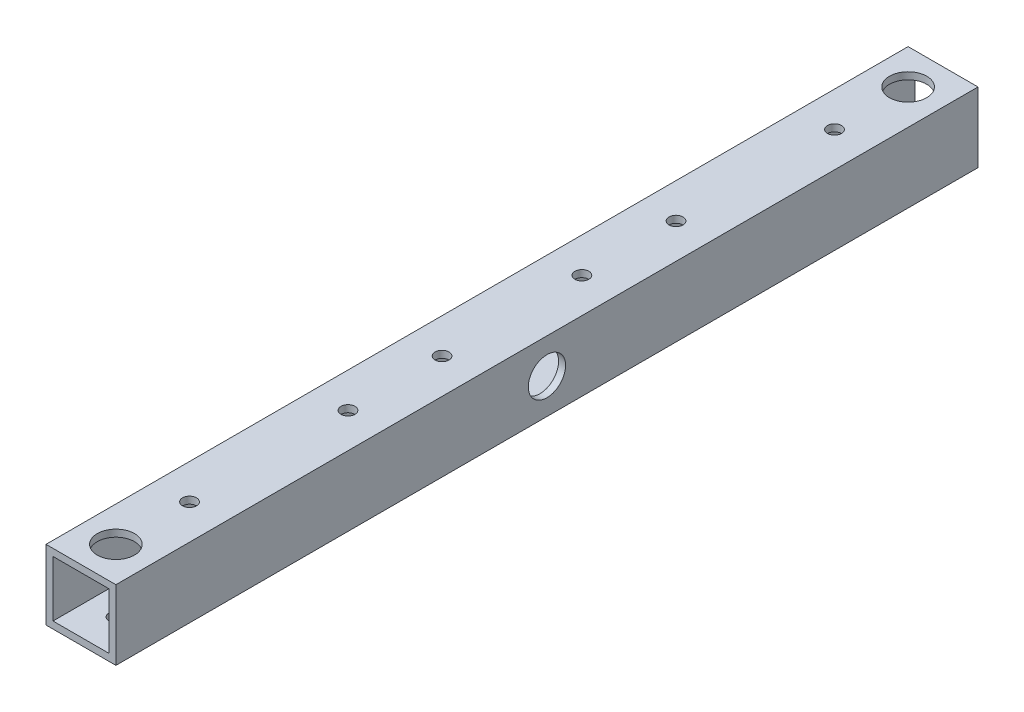
ISO-10303-21;
HEADER;
FILE_DESCRIPTION(('STEP AP214'),'2;1');
FILE_NAME('part.step','',(''),(''),'','','');
FILE_SCHEMA(('AUTOMOTIVE_DESIGN { 1 0 10303 214 1 1 1 1 }'));
ENDSEC;
DATA;
#1=APPLICATION_CONTEXT('core data for automotive mechanical design processes');
#2=APPLICATION_PROTOCOL_DEFINITION('international standard','automotive_design',2000,#1);
#3=PRODUCT_CONTEXT('',#1,'mechanical');
#4=PRODUCT('Part','Part','',(#3));
#5=PRODUCT_RELATED_PRODUCT_CATEGORY('part','',(#4));
#6=PRODUCT_DEFINITION_FORMATION('','',#4);
#7=PRODUCT_DEFINITION_CONTEXT('part definition',#1,'design');
#8=PRODUCT_DEFINITION('design','',#6,#7);
#9=PRODUCT_DEFINITION_SHAPE('','',#8);
#10=(LENGTH_UNIT() NAMED_UNIT(*) SI_UNIT(.MILLI.,.METRE.));
#11=(NAMED_UNIT(*) PLANE_ANGLE_UNIT() SI_UNIT($,.RADIAN.));
#12=(NAMED_UNIT(*) SI_UNIT($,.STERADIAN.) SOLID_ANGLE_UNIT());
#13=UNCERTAINTY_MEASURE_WITH_UNIT(LENGTH_MEASURE(1.E-05),#10,'distance_accuracy_value','');
#14=(GEOMETRIC_REPRESENTATION_CONTEXT(3) GLOBAL_UNCERTAINTY_ASSIGNED_CONTEXT((#13)) GLOBAL_UNIT_ASSIGNED_CONTEXT((#10,
#11,#12)) REPRESENTATION_CONTEXT('',''));
#15=CARTESIAN_POINT('',(0.,0.,0.));
#16=DIRECTION('',(0.,0.,1.));
#17=DIRECTION('',(1.,0.,0.));
#18=AXIS2_PLACEMENT_3D('',#15,#16,#17);
#19=CARTESIAN_POINT('',(0.,0.,185.));
#20=DIRECTION('',(0.,0.,1.));
#21=DIRECTION('',(1.,0.,0.));
#22=AXIS2_PLACEMENT_3D('',#19,#20,#21);
#23=PLANE('',#22);
#24=DIRECTION('',(0.,-1.,0.));
#25=VECTOR('',#24,1.);
#26=CARTESIAN_POINT('',(-7.01008414074451,7.73262608579252,185.));
#27=LINE('',#26,#25);
#28=CARTESIAN_POINT('',(-7.01008414074451,7.73262608579252,185.));
#29=VERTEX_POINT('',#28);
#30=CARTESIAN_POINT('',(-7.01008414074451,-7.26737391420748,185.));
#31=VERTEX_POINT('',#30);
#32=EDGE_CURVE('E146',#29,#31,#27,.T.);
#33=ORIENTED_EDGE('',*,*,#32,.T.);
#34=DIRECTION('',(1.,0.,0.));
#35=VECTOR('',#34,1.);
#36=CARTESIAN_POINT('',(-7.01008414074451,-7.26737391420748,185.));
#37=LINE('',#36,#35);
#38=CARTESIAN_POINT('',(7.98991585925548,-7.26737391420748,185.));
#39=VERTEX_POINT('',#38);
#40=EDGE_CURVE('E149',#31,#39,#37,.T.);
#41=ORIENTED_EDGE('',*,*,#40,.T.);
#42=DIRECTION('',(0.,1.,0.));
#43=VECTOR('',#42,1.);
#44=CARTESIAN_POINT('',(7.98991585925549,7.73262608579252,185.));
#45=LINE('',#44,#43);
#46=CARTESIAN_POINT('',(7.98991585925549,7.73262608579252,185.));
#47=VERTEX_POINT('',#46);
#48=EDGE_CURVE('E152',#39,#47,#45,.T.);
#49=ORIENTED_EDGE('',*,*,#48,.T.);
#50=DIRECTION('',(-1.,0.,0.));
#51=VECTOR('',#50,1.);
#52=CARTESIAN_POINT('',(-7.01008414074451,7.73262608579252,185.));
#53=LINE('',#52,#51);
#54=EDGE_CURVE('E154',#47,#29,#53,.T.);
#55=ORIENTED_EDGE('',*,*,#54,.T.);
#56=EDGE_LOOP('',(#33,#41,#49,#55));
#57=FACE_BOUND('',#56,.T.);
#58=DIRECTION('',(1.,0.,0.));
#59=VECTOR('',#58,1.);
#60=CARTESIAN_POINT('',(-5.51008414074451,-5.76737391420748,185.));
#61=LINE('',#60,#59);
#62=CARTESIAN_POINT('',(-5.51008414074451,-5.76737391420748,185.));
#63=VERTEX_POINT('',#62);
#64=CARTESIAN_POINT('',(6.48991585925549,-5.76737391420748,185.));
#65=VERTEX_POINT('',#64);
#66=EDGE_CURVE('E116',#63,#65,#61,.T.);
#67=ORIENTED_EDGE('',*,*,#66,.F.);
#68=DIRECTION('',(0.,-1.,0.));
#69=VECTOR('',#68,1.);
#70=CARTESIAN_POINT('',(-5.51008414074451,6.23262608579252,185.));
#71=LINE('',#70,#69);
#72=CARTESIAN_POINT('',(-5.51008414074451,6.23262608579252,185.));
#73=VERTEX_POINT('',#72);
#74=EDGE_CURVE('E108',#73,#63,#71,.T.);
#75=ORIENTED_EDGE('',*,*,#74,.F.);
#76=DIRECTION('',(-1.,0.,0.));
#77=VECTOR('',#76,1.);
#78=CARTESIAN_POINT('',(-5.51008414074451,6.23262608579252,185.));
#79=LINE('',#78,#77);
#80=CARTESIAN_POINT('',(6.48991585925549,6.23262608579252,185.));
#81=VERTEX_POINT('',#80);
#82=EDGE_CURVE('E130',#81,#73,#79,.T.);
#83=ORIENTED_EDGE('',*,*,#82,.F.);
#84=DIRECTION('',(0.,1.,0.));
#85=VECTOR('',#84,1.);
#86=CARTESIAN_POINT('',(6.48991585925549,6.23262608579252,185.));
#87=LINE('',#86,#85);
#88=EDGE_CURVE('E128',#65,#81,#87,.T.);
#89=ORIENTED_EDGE('',*,*,#88,.F.);
#90=EDGE_LOOP('',(#67,#75,#83,#89));
#91=FACE_BOUND('',#90,.T.);
#92=ADVANCED_FACE('F41',(#57,#91),#23,.T.);
#93=CARTESIAN_POINT('',(0.,0.,0.));
#94=DIRECTION('',(0.,0.,1.));
#95=DIRECTION('',(1.,0.,0.));
#96=AXIS2_PLACEMENT_3D('',#93,#94,#95);
#97=PLANE('',#96);
#98=DIRECTION('',(0.,-1.,0.));
#99=VECTOR('',#98,1.);
#100=CARTESIAN_POINT('',(-7.01008414074451,7.73262608579252,0.));
#101=LINE('',#100,#99);
#102=CARTESIAN_POINT('',(-7.01008414074451,7.73262608579252,0.));
#103=VERTEX_POINT('',#102);
#104=CARTESIAN_POINT('',(-7.01008414074451,-7.26737391420748,0.));
#105=VERTEX_POINT('',#104);
#106=EDGE_CURVE('E124',#103,#105,#101,.T.);
#107=ORIENTED_EDGE('',*,*,#106,.F.);
#108=DIRECTION('',(-1.,0.,0.));
#109=VECTOR('',#108,1.);
#110=CARTESIAN_POINT('',(-7.01008414074451,7.73262608579252,0.));
#111=LINE('',#110,#109);
#112=CARTESIAN_POINT('',(7.98991585925549,7.73262608579252,0.));
#113=VERTEX_POINT('',#112);
#114=EDGE_CURVE('E150',#113,#103,#111,.T.);
#115=ORIENTED_EDGE('',*,*,#114,.F.);
#116=DIRECTION('',(0.,1.,0.));
#117=VECTOR('',#116,1.);
#118=CARTESIAN_POINT('',(7.98991585925549,7.73262608579252,0.));
#119=LINE('',#118,#117);
#120=CARTESIAN_POINT('',(7.98991585925548,-7.26737391420748,0.));
#121=VERTEX_POINT('',#120);
#122=EDGE_CURVE('E161',#121,#113,#119,.T.);
#123=ORIENTED_EDGE('',*,*,#122,.F.);
#124=DIRECTION('',(1.,0.,0.));
#125=VECTOR('',#124,1.);
#126=CARTESIAN_POINT('',(-7.01008414074451,-7.26737391420748,0.));
#127=LINE('',#126,#125);
#128=EDGE_CURVE('E159',#105,#121,#127,.T.);
#129=ORIENTED_EDGE('',*,*,#128,.F.);
#130=EDGE_LOOP('',(#107,#115,#123,#129));
#131=FACE_BOUND('',#130,.T.);
#132=DIRECTION('',(0.,-1.,0.));
#133=VECTOR('',#132,1.);
#134=CARTESIAN_POINT('',(-5.51008414074451,6.23262608579252,0.));
#135=LINE('',#134,#133);
#136=CARTESIAN_POINT('',(-5.51008414074451,6.23262608579252,0.));
#137=VERTEX_POINT('',#136);
#138=CARTESIAN_POINT('',(-5.51008414074451,-5.76737391420748,0.));
#139=VERTEX_POINT('',#138);
#140=EDGE_CURVE('E66',#137,#139,#135,.T.);
#141=ORIENTED_EDGE('',*,*,#140,.T.);
#142=DIRECTION('',(1.,0.,0.));
#143=VECTOR('',#142,1.);
#144=CARTESIAN_POINT('',(-5.51008414074451,-5.76737391420748,0.));
#145=LINE('',#144,#143);
#146=CARTESIAN_POINT('',(6.48991585925549,-5.76737391420748,0.));
#147=VERTEX_POINT('',#146);
#148=EDGE_CURVE('E123',#139,#147,#145,.T.);
#149=ORIENTED_EDGE('',*,*,#148,.T.);
#150=DIRECTION('',(0.,1.,0.));
#151=VECTOR('',#150,1.);
#152=CARTESIAN_POINT('',(6.48991585925549,6.23262608579252,0.));
#153=LINE('',#152,#151);
#154=CARTESIAN_POINT('',(6.48991585925549,6.23262608579252,0.));
#155=VERTEX_POINT('',#154);
#156=EDGE_CURVE('E138',#147,#155,#153,.T.);
#157=ORIENTED_EDGE('',*,*,#156,.T.);
#158=DIRECTION('',(-1.,0.,0.));
#159=VECTOR('',#158,1.);
#160=CARTESIAN_POINT('',(-5.51008414074451,6.23262608579252,0.));
#161=LINE('',#160,#159);
#162=EDGE_CURVE('E117',#155,#137,#161,.T.);
#163=ORIENTED_EDGE('',*,*,#162,.T.);
#164=EDGE_LOOP('',(#141,#149,#157,#163));
#165=FACE_BOUND('',#164,.T.);
#166=ADVANCED_FACE('F296',(#131,#165),#97,.F.);
#167=CARTESIAN_POINT('',(-7.01008414074451,7.73262608579252,185.));
#168=DIRECTION('',(1.,0.,0.));
#169=DIRECTION('',(0.,1.,0.));
#170=AXIS2_PLACEMENT_3D('',#167,#168,#169);
#171=PLANE('',#170);
#172=CARTESIAN_POINT('',(-7.01008414074451,0.232626085792518,92.5));
#173=DIRECTION('',(-1.,0.,0.));
#174=DIRECTION('',(0.,-1.,0.));
#175=AXIS2_PLACEMENT_3D('',#172,#173,#174);
#176=CIRCLE('',#175,1.5);
#177=CARTESIAN_POINT('',(-7.01008414074451,-1.26737391420748,92.5));
#178=VERTEX_POINT('',#177);
#179=EDGE_CURVE('E189',#178,#178,#176,.T.);
#180=ORIENTED_EDGE('',*,*,#179,.F.);
#181=EDGE_LOOP('',(#180));
#182=FACE_BOUND('',#181,.T.);
#183=ORIENTED_EDGE('',*,*,#106,.T.);
#184=DIRECTION('',(0.,0.,-1.));
#185=VECTOR('',#184,1.);
#186=CARTESIAN_POINT('',(-7.01008414074451,-7.26737391420748,185.));
#187=LINE('',#186,#185);
#188=EDGE_CURVE('E12',#31,#105,#187,.T.);
#189=ORIENTED_EDGE('',*,*,#188,.F.);
#190=ORIENTED_EDGE('',*,*,#32,.F.);
#191=DIRECTION('',(0.,0.,-1.));
#192=VECTOR('',#191,1.);
#193=CARTESIAN_POINT('',(-7.01008414074451,7.73262608579252,185.));
#194=LINE('',#193,#192);
#195=EDGE_CURVE('E156',#29,#103,#194,.T.);
#196=ORIENTED_EDGE('',*,*,#195,.T.);
#197=EDGE_LOOP('',(#183,#189,#190,#196));
#198=FACE_BOUND('',#197,.T.);
#199=ADVANCED_FACE('F43',(#182,#198),#171,.F.);
#200=CARTESIAN_POINT('',(-7.01008414074451,-7.26737391420748,185.));
#201=DIRECTION('',(0.,1.,0.));
#202=DIRECTION('',(0.,0.,1.));
#203=AXIS2_PLACEMENT_3D('',#200,#201,#202);
#204=PLANE('',#203);
#205=CARTESIAN_POINT('',(0.489915859255488,-7.26737391420748,127.7));
#206=DIRECTION('',(0.,-1.,0.));
#207=DIRECTION('',(0.,0.,-1.));
#208=AXIS2_PLACEMENT_3D('',#205,#206,#207);
#209=CIRCLE('',#208,4.);
#210=CARTESIAN_POINT('',(0.489915859255488,-7.26737391420748,123.7));
#211=VERTEX_POINT('',#210);
#212=EDGE_CURVE('E245',#211,#211,#209,.T.);
#213=ORIENTED_EDGE('',*,*,#212,.F.);
#214=EDGE_LOOP('',(#213));
#215=FACE_BOUND('',#214,.T.);
#216=CARTESIAN_POINT('',(0.489915859255487,-7.26737391420748,161.7));
#217=DIRECTION('',(0.,-1.,0.));
#218=DIRECTION('',(0.,0.,-1.));
#219=AXIS2_PLACEMENT_3D('',#216,#217,#218);
#220=CIRCLE('',#219,4.);
#221=CARTESIAN_POINT('',(0.489915859255487,-7.26737391420748,157.7));
#222=VERTEX_POINT('',#221);
#223=EDGE_CURVE('E235',#222,#222,#220,.T.);
#224=ORIENTED_EDGE('',*,*,#223,.F.);
#225=EDGE_LOOP('',(#224));
#226=FACE_BOUND('',#225,.T.);
#227=CARTESIAN_POINT('',(0.489915859255487,-7.26737391420748,57.3));
#228=DIRECTION('',(0.,-1.,0.));
#229=DIRECTION('',(0.,0.,-1.));
#230=AXIS2_PLACEMENT_3D('',#227,#228,#229);
#231=CIRCLE('',#230,4.);
#232=CARTESIAN_POINT('',(0.489915859255487,-7.26737391420748,53.3));
#233=VERTEX_POINT('',#232);
#234=EDGE_CURVE('E225',#233,#233,#231,.T.);
#235=ORIENTED_EDGE('',*,*,#234,.F.);
#236=EDGE_LOOP('',(#235));
#237=FACE_BOUND('',#236,.T.);
#238=CARTESIAN_POINT('',(0.489915859255487,-7.26737391420748,23.3));
#239=DIRECTION('',(0.,-1.,0.));
#240=DIRECTION('',(0.,0.,-1.));
#241=AXIS2_PLACEMENT_3D('',#238,#239,#240);
#242=CIRCLE('',#241,4.);
#243=CARTESIAN_POINT('',(0.489915859255487,-7.26737391420748,19.3));
#244=VERTEX_POINT('',#243);
#245=EDGE_CURVE('E221',#244,#244,#242,.T.);
#246=ORIENTED_EDGE('',*,*,#245,.F.);
#247=EDGE_LOOP('',(#246));
#248=FACE_BOUND('',#247,.T.);
#249=CARTESIAN_POINT('',(0.489915859255483,-7.26737391420748,107.5));
#250=DIRECTION('',(0.,-1.,0.));
#251=DIRECTION('',(0.,0.,-1.));
#252=AXIS2_PLACEMENT_3D('',#249,#250,#251);
#253=CIRCLE('',#252,4.);
#254=CARTESIAN_POINT('',(0.489915859255483,-7.26737391420748,103.5));
#255=VERTEX_POINT('',#254);
#256=EDGE_CURVE('E209',#255,#255,#253,.T.);
#257=ORIENTED_EDGE('',*,*,#256,.F.);
#258=EDGE_LOOP('',(#257));
#259=FACE_BOUND('',#258,.T.);
#260=CARTESIAN_POINT('',(0.489915859255483,-7.26737391420748,77.5));
#261=DIRECTION('',(0.,-1.,0.));
#262=DIRECTION('',(0.,0.,-1.));
#263=AXIS2_PLACEMENT_3D('',#260,#261,#262);
#264=CIRCLE('',#263,4.);
#265=CARTESIAN_POINT('',(0.489915859255483,-7.26737391420748,73.5));
#266=VERTEX_POINT('',#265);
#267=EDGE_CURVE('E205',#266,#266,#264,.T.);
#268=ORIENTED_EDGE('',*,*,#267,.F.);
#269=EDGE_LOOP('',(#268));
#270=FACE_BOUND('',#269,.T.);
#271=CARTESIAN_POINT('',(0.489915859255484,-7.26737391420748,7.5));
#272=DIRECTION('',(0.,-1.,0.));
#273=DIRECTION('',(0.,0.,-1.));
#274=AXIS2_PLACEMENT_3D('',#271,#272,#273);
#275=CIRCLE('',#274,1.5);
#276=CARTESIAN_POINT('',(0.489915859255484,-7.26737391420748,6.));
#277=VERTEX_POINT('',#276);
#278=EDGE_CURVE('E185',#277,#277,#275,.T.);
#279=ORIENTED_EDGE('',*,*,#278,.F.);
#280=EDGE_LOOP('',(#279));
#281=FACE_BOUND('',#280,.T.);
#282=CARTESIAN_POINT('',(0.489915859255484,-7.26737391420748,177.5));
#283=DIRECTION('',(0.,-1.,0.));
#284=DIRECTION('',(0.,0.,-1.));
#285=AXIS2_PLACEMENT_3D('',#282,#283,#284);
#286=CIRCLE('',#285,1.5);
#287=CARTESIAN_POINT('',(0.489915859255484,-7.26737391420748,176.));
#288=VERTEX_POINT('',#287);
#289=EDGE_CURVE('E177',#288,#288,#286,.T.);
#290=ORIENTED_EDGE('',*,*,#289,.F.);
#291=EDGE_LOOP('',(#290));
#292=FACE_BOUND('',#291,.T.);
#293=ORIENTED_EDGE('',*,*,#128,.T.);
#294=DIRECTION('',(0.,0.,-1.));
#295=VECTOR('',#294,1.);
#296=CARTESIAN_POINT('',(7.98991585925548,-7.26737391420748,185.));
#297=LINE('',#296,#295);
#298=EDGE_CURVE('E50',#39,#121,#297,.T.);
#299=ORIENTED_EDGE('',*,*,#298,.F.);
#300=ORIENTED_EDGE('',*,*,#40,.F.);
#301=ORIENTED_EDGE('',*,*,#188,.T.);
#302=EDGE_LOOP('',(#293,#299,#300,#301));
#303=FACE_BOUND('',#302,.T.);
#304=ADVANCED_FACE('F300',(#215,#226,#237,#248,#259,#270,#281,#292,#303),#204,.F.);
#305=CARTESIAN_POINT('',(7.98991585925549,7.73262608579252,185.));
#306=DIRECTION('',(-1.,0.,0.));
#307=DIRECTION('',(0.,-1.,0.));
#308=AXIS2_PLACEMENT_3D('',#305,#306,#307);
#309=PLANE('',#308);
#310=CARTESIAN_POINT('',(7.98991585925548,0.232626085792525,92.5));
#311=DIRECTION('',(1.,0.,0.));
#312=DIRECTION('',(0.,1.,0.));
#313=AXIS2_PLACEMENT_3D('',#310,#311,#312);
#314=CIRCLE('',#313,4.00000000000001);
#315=CARTESIAN_POINT('',(7.98991585925549,4.23262608579253,92.5));
#316=VERTEX_POINT('',#315);
#317=EDGE_CURVE('E193',#316,#316,#314,.T.);
#318=ORIENTED_EDGE('',*,*,#317,.F.);
#319=EDGE_LOOP('',(#318));
#320=FACE_BOUND('',#319,.T.);
#321=ORIENTED_EDGE('',*,*,#122,.T.);
#322=DIRECTION('',(0.,0.,-1.));
#323=VECTOR('',#322,1.);
#324=CARTESIAN_POINT('',(7.98991585925549,7.73262608579252,185.));
#325=LINE('',#324,#323);
#326=EDGE_CURVE('E166',#47,#113,#325,.T.);
#327=ORIENTED_EDGE('',*,*,#326,.F.);
#328=ORIENTED_EDGE('',*,*,#48,.F.);
#329=ORIENTED_EDGE('',*,*,#298,.T.);
#330=EDGE_LOOP('',(#321,#327,#328,#329));
#331=FACE_BOUND('',#330,.T.);
#332=ADVANCED_FACE('F283',(#320,#331),#309,.F.);
#333=CARTESIAN_POINT('',(-7.01008414074451,7.73262608579252,185.));
#334=DIRECTION('',(0.,-1.,0.));
#335=DIRECTION('',(0.,0.,-1.));
#336=AXIS2_PLACEMENT_3D('',#333,#334,#335);
#337=PLANE('',#336);
#338=CARTESIAN_POINT('',(0.489915859255488,7.73262608579252,127.7));
#339=DIRECTION('',(0.,1.,0.));
#340=DIRECTION('',(0.,0.,1.));
#341=AXIS2_PLACEMENT_3D('',#338,#339,#340);
#342=CIRCLE('',#341,1.5);
#343=CARTESIAN_POINT('',(0.489915859255488,7.73262608579252,129.2));
#344=VERTEX_POINT('',#343);
#345=EDGE_CURVE('E232',#344,#344,#342,.T.);
#346=ORIENTED_EDGE('',*,*,#345,.F.);
#347=EDGE_LOOP('',(#346));
#348=FACE_BOUND('',#347,.T.);
#349=CARTESIAN_POINT('',(0.489915859255487,7.73262608579252,161.7));
#350=DIRECTION('',(0.,1.,0.));
#351=DIRECTION('',(0.,0.,1.));
#352=AXIS2_PLACEMENT_3D('',#349,#350,#351);
#353=CIRCLE('',#352,1.5);
#354=CARTESIAN_POINT('',(0.489915859255487,7.73262608579252,163.2));
#355=VERTEX_POINT('',#354);
#356=EDGE_CURVE('E229',#355,#355,#353,.T.);
#357=ORIENTED_EDGE('',*,*,#356,.F.);
#358=EDGE_LOOP('',(#357));
#359=FACE_BOUND('',#358,.T.);
#360=CARTESIAN_POINT('',(0.489915859255487,7.73262608579252,57.3));
#361=DIRECTION('',(0.,1.,0.));
#362=DIRECTION('',(0.,0.,1.));
#363=AXIS2_PLACEMENT_3D('',#360,#361,#362);
#364=CIRCLE('',#363,1.5);
#365=CARTESIAN_POINT('',(0.489915859255487,7.73262608579252,58.8));
#366=VERTEX_POINT('',#365);
#367=EDGE_CURVE('E217',#366,#366,#364,.T.);
#368=ORIENTED_EDGE('',*,*,#367,.F.);
#369=EDGE_LOOP('',(#368));
#370=FACE_BOUND('',#369,.T.);
#371=CARTESIAN_POINT('',(0.489915859255487,7.73262608579252,23.3));
#372=DIRECTION('',(0.,1.,0.));
#373=DIRECTION('',(0.,0.,1.));
#374=AXIS2_PLACEMENT_3D('',#371,#372,#373);
#375=CIRCLE('',#374,1.5);
#376=CARTESIAN_POINT('',(0.489915859255487,7.73262608579252,24.8));
#377=VERTEX_POINT('',#376);
#378=EDGE_CURVE('E213',#377,#377,#375,.T.);
#379=ORIENTED_EDGE('',*,*,#378,.F.);
#380=EDGE_LOOP('',(#379));
#381=FACE_BOUND('',#380,.T.);
#382=CARTESIAN_POINT('',(0.489915859255486,7.73262608579252,107.5));
#383=DIRECTION('',(0.,1.,0.));
#384=DIRECTION('',(0.,0.,1.));
#385=AXIS2_PLACEMENT_3D('',#382,#383,#384);
#386=CIRCLE('',#385,1.5);
#387=CARTESIAN_POINT('',(0.489915859255486,7.73262608579252,109.));
#388=VERTEX_POINT('',#387);
#389=EDGE_CURVE('E201',#388,#388,#386,.T.);
#390=ORIENTED_EDGE('',*,*,#389,.F.);
#391=EDGE_LOOP('',(#390));
#392=FACE_BOUND('',#391,.T.);
#393=CARTESIAN_POINT('',(0.489915859255486,7.73262608579252,77.5));
#394=DIRECTION('',(0.,1.,0.));
#395=DIRECTION('',(0.,0.,1.));
#396=AXIS2_PLACEMENT_3D('',#393,#394,#395);
#397=CIRCLE('',#396,1.5);
#398=CARTESIAN_POINT('',(0.489915859255486,7.73262608579252,79.));
#399=VERTEX_POINT('',#398);
#400=EDGE_CURVE('E197',#399,#399,#397,.T.);
#401=ORIENTED_EDGE('',*,*,#400,.F.);
#402=EDGE_LOOP('',(#401));
#403=FACE_BOUND('',#402,.T.);
#404=CARTESIAN_POINT('',(0.489915859255487,7.73262608579252,7.5));
#405=DIRECTION('',(0.,1.,0.));
#406=DIRECTION('',(0.,0.,1.));
#407=AXIS2_PLACEMENT_3D('',#404,#405,#406);
#408=CIRCLE('',#407,4.);
#409=CARTESIAN_POINT('',(0.489915859255487,7.73262608579252,11.5));
#410=VERTEX_POINT('',#409);
#411=EDGE_CURVE('E181',#410,#410,#408,.T.);
#412=ORIENTED_EDGE('',*,*,#411,.F.);
#413=EDGE_LOOP('',(#412));
#414=FACE_BOUND('',#413,.T.);
#415=CARTESIAN_POINT('',(0.489915859255487,7.73262608579252,177.5));
#416=DIRECTION('',(0.,1.,0.));
#417=DIRECTION('',(0.,0.,1.));
#418=AXIS2_PLACEMENT_3D('',#415,#416,#417);
#419=CIRCLE('',#418,4.);
#420=CARTESIAN_POINT('',(0.489915859255487,7.73262608579252,181.5));
#421=VERTEX_POINT('',#420);
#422=EDGE_CURVE('E173',#421,#421,#419,.T.);
#423=ORIENTED_EDGE('',*,*,#422,.F.);
#424=EDGE_LOOP('',(#423));
#425=FACE_BOUND('',#424,.T.);
#426=ORIENTED_EDGE('',*,*,#114,.T.);
#427=ORIENTED_EDGE('',*,*,#195,.F.);
#428=ORIENTED_EDGE('',*,*,#54,.F.);
#429=ORIENTED_EDGE('',*,*,#326,.T.);
#430=EDGE_LOOP('',(#426,#427,#428,#429));
#431=FACE_BOUND('',#430,.T.);
#432=ADVANCED_FACE('F280',(#348,#359,#370,#381,#392,#403,#414,#425,#431),#337,.F.);
#433=CARTESIAN_POINT('',(-5.51008414074451,6.23262608579252,185.));
#434=DIRECTION('',(1.,0.,0.));
#435=DIRECTION('',(0.,1.,0.));
#436=AXIS2_PLACEMENT_3D('',#433,#434,#435);
#437=PLANE('',#436);
#438=CARTESIAN_POINT('',(-5.51008414074451,0.232626085792519,92.5));
#439=DIRECTION('',(1.,0.,0.));
#440=DIRECTION('',(0.,1.,0.));
#441=AXIS2_PLACEMENT_3D('',#438,#439,#440);
#442=CIRCLE('',#441,1.5);
#443=CARTESIAN_POINT('',(-5.51008414074451,1.73262608579252,92.5));
#444=VERTEX_POINT('',#443);
#445=EDGE_CURVE('E186',#444,#444,#442,.T.);
#446=ORIENTED_EDGE('',*,*,#445,.F.);
#447=EDGE_LOOP('',(#446));
#448=FACE_BOUND('',#447,.T.);
#449=ORIENTED_EDGE('',*,*,#140,.F.);
#450=DIRECTION('',(0.,0.,-1.));
#451=VECTOR('',#450,1.);
#452=CARTESIAN_POINT('',(-5.51008414074451,6.23262608579252,185.));
#453=LINE('',#452,#451);
#454=EDGE_CURVE('E112',#73,#137,#453,.T.);
#455=ORIENTED_EDGE('',*,*,#454,.F.);
#456=ORIENTED_EDGE('',*,*,#74,.T.);
#457=DIRECTION('',(0.,0.,-1.));
#458=VECTOR('',#457,1.);
#459=CARTESIAN_POINT('',(-5.51008414074451,-5.76737391420748,185.));
#460=LINE('',#459,#458);
#461=EDGE_CURVE('E111',#63,#139,#460,.T.);
#462=ORIENTED_EDGE('',*,*,#461,.T.);
#463=EDGE_LOOP('',(#449,#455,#456,#462));
#464=FACE_BOUND('',#463,.T.);
#465=ADVANCED_FACE('F110',(#448,#464),#437,.T.);
#466=CARTESIAN_POINT('',(-5.51008414074451,-5.76737391420748,185.));
#467=DIRECTION('',(0.,1.,0.));
#468=DIRECTION('',(0.,0.,1.));
#469=AXIS2_PLACEMENT_3D('',#466,#467,#468);
#470=PLANE('',#469);
#471=CARTESIAN_POINT('',(0.489915859255488,-5.76737391420748,127.7));
#472=DIRECTION('',(0.,1.,0.));
#473=DIRECTION('',(0.,0.,1.));
#474=AXIS2_PLACEMENT_3D('',#471,#472,#473);
#475=CIRCLE('',#474,4.);
#476=CARTESIAN_POINT('',(0.489915859255488,-5.76737391420748,131.7));
#477=VERTEX_POINT('',#476);
#478=EDGE_CURVE('E45',#477,#477,#475,.T.);
#479=ORIENTED_EDGE('',*,*,#478,.F.);
#480=EDGE_LOOP('',(#479));
#481=FACE_BOUND('',#480,.T.);
#482=CARTESIAN_POINT('',(0.489915859255487,-5.76737391420748,161.7));
#483=DIRECTION('',(0.,1.,0.));
#484=DIRECTION('',(0.,0.,1.));
#485=AXIS2_PLACEMENT_3D('',#482,#483,#484);
#486=CIRCLE('',#485,4.);
#487=CARTESIAN_POINT('',(0.489915859255487,-5.76737391420748,165.7));
#488=VERTEX_POINT('',#487);
#489=EDGE_CURVE('E233',#488,#488,#486,.T.);
#490=ORIENTED_EDGE('',*,*,#489,.F.);
#491=EDGE_LOOP('',(#490));
#492=FACE_BOUND('',#491,.T.);
#493=CARTESIAN_POINT('',(0.489915859255487,-5.76737391420748,57.3));
#494=DIRECTION('',(0.,1.,0.));
#495=DIRECTION('',(0.,0.,1.));
#496=AXIS2_PLACEMENT_3D('',#493,#494,#495);
#497=CIRCLE('',#496,4.);
#498=CARTESIAN_POINT('',(0.489915859255487,-5.76737391420748,61.3));
#499=VERTEX_POINT('',#498);
#500=EDGE_CURVE('E222',#499,#499,#497,.T.);
#501=ORIENTED_EDGE('',*,*,#500,.F.);
#502=EDGE_LOOP('',(#501));
#503=FACE_BOUND('',#502,.T.);
#504=CARTESIAN_POINT('',(0.489915859255487,-5.76737391420748,23.3));
#505=DIRECTION('',(0.,1.,0.));
#506=DIRECTION('',(0.,0.,1.));
#507=AXIS2_PLACEMENT_3D('',#504,#505,#506);
#508=CIRCLE('',#507,4.);
#509=CARTESIAN_POINT('',(0.489915859255487,-5.76737391420748,27.3));
#510=VERTEX_POINT('',#509);
#511=EDGE_CURVE('E218',#510,#510,#508,.T.);
#512=ORIENTED_EDGE('',*,*,#511,.F.);
#513=EDGE_LOOP('',(#512));
#514=FACE_BOUND('',#513,.T.);
#515=CARTESIAN_POINT('',(0.489915859255483,-5.76737391420748,107.5));
#516=DIRECTION('',(0.,1.,0.));
#517=DIRECTION('',(0.,0.,1.));
#518=AXIS2_PLACEMENT_3D('',#515,#516,#517);
#519=CIRCLE('',#518,4.);
#520=CARTESIAN_POINT('',(0.489915859255483,-5.76737391420748,111.5));
#521=VERTEX_POINT('',#520);
#522=EDGE_CURVE('E206',#521,#521,#519,.T.);
#523=ORIENTED_EDGE('',*,*,#522,.F.);
#524=EDGE_LOOP('',(#523));
#525=FACE_BOUND('',#524,.T.);
#526=CARTESIAN_POINT('',(0.489915859255483,-5.76737391420748,77.5));
#527=DIRECTION('',(0.,1.,0.));
#528=DIRECTION('',(0.,0.,1.));
#529=AXIS2_PLACEMENT_3D('',#526,#527,#528);
#530=CIRCLE('',#529,4.);
#531=CARTESIAN_POINT('',(0.489915859255483,-5.76737391420748,81.5));
#532=VERTEX_POINT('',#531);
#533=EDGE_CURVE('E202',#532,#532,#530,.T.);
#534=ORIENTED_EDGE('',*,*,#533,.F.);
#535=EDGE_LOOP('',(#534));
#536=FACE_BOUND('',#535,.T.);
#537=CARTESIAN_POINT('',(0.489915859255484,-5.76737391420748,7.5));
#538=DIRECTION('',(0.,1.,0.));
#539=DIRECTION('',(0.,0.,1.));
#540=AXIS2_PLACEMENT_3D('',#537,#538,#539);
#541=CIRCLE('',#540,1.5);
#542=CARTESIAN_POINT('',(0.489915859255484,-5.76737391420748,9.));
#543=VERTEX_POINT('',#542);
#544=EDGE_CURVE('E182',#543,#543,#541,.T.);
#545=ORIENTED_EDGE('',*,*,#544,.F.);
#546=EDGE_LOOP('',(#545));
#547=FACE_BOUND('',#546,.T.);
#548=CARTESIAN_POINT('',(0.489915859255484,-5.76737391420748,177.5));
#549=DIRECTION('',(0.,1.,0.));
#550=DIRECTION('',(0.,0.,1.));
#551=AXIS2_PLACEMENT_3D('',#548,#549,#550);
#552=CIRCLE('',#551,1.5);
#553=CARTESIAN_POINT('',(0.489915859255484,-5.76737391420748,179.));
#554=VERTEX_POINT('',#553);
#555=EDGE_CURVE('E174',#554,#554,#552,.T.);
#556=ORIENTED_EDGE('',*,*,#555,.F.);
#557=EDGE_LOOP('',(#556));
#558=FACE_BOUND('',#557,.T.);
#559=ORIENTED_EDGE('',*,*,#148,.F.);
#560=ORIENTED_EDGE('',*,*,#461,.F.);
#561=ORIENTED_EDGE('',*,*,#66,.T.);
#562=DIRECTION('',(0.,0.,-1.));
#563=VECTOR('',#562,1.);
#564=CARTESIAN_POINT('',(6.48991585925549,-5.76737391420748,185.));
#565=LINE('',#564,#563);
#566=EDGE_CURVE('E125',#65,#147,#565,.T.);
#567=ORIENTED_EDGE('',*,*,#566,.T.);
#568=EDGE_LOOP('',(#559,#560,#561,#567));
#569=FACE_BOUND('',#568,.T.);
#570=ADVANCED_FACE('F120',(#481,#492,#503,#514,#525,#536,#547,#558,#569),#470,.T.);
#571=CARTESIAN_POINT('',(6.48991585925549,6.23262608579252,185.));
#572=DIRECTION('',(-1.,0.,0.));
#573=DIRECTION('',(0.,-1.,0.));
#574=AXIS2_PLACEMENT_3D('',#571,#572,#573);
#575=PLANE('',#574);
#576=CARTESIAN_POINT('',(6.48991585925549,0.232626085792525,92.5));
#577=DIRECTION('',(-1.,0.,0.));
#578=DIRECTION('',(0.,-1.,0.));
#579=AXIS2_PLACEMENT_3D('',#576,#577,#578);
#580=CIRCLE('',#579,4.00000000000001);
#581=CARTESIAN_POINT('',(6.48991585925549,-3.76737391420748,92.5));
#582=VERTEX_POINT('',#581);
#583=EDGE_CURVE('E190',#582,#582,#580,.T.);
#584=ORIENTED_EDGE('',*,*,#583,.F.);
#585=EDGE_LOOP('',(#584));
#586=FACE_BOUND('',#585,.T.);
#587=ORIENTED_EDGE('',*,*,#156,.F.);
#588=ORIENTED_EDGE('',*,*,#566,.F.);
#589=ORIENTED_EDGE('',*,*,#88,.T.);
#590=DIRECTION('',(0.,0.,-1.));
#591=VECTOR('',#590,1.);
#592=CARTESIAN_POINT('',(6.48991585925549,6.23262608579252,185.));
#593=LINE('',#592,#591);
#594=EDGE_CURVE('E58',#81,#155,#593,.T.);
#595=ORIENTED_EDGE('',*,*,#594,.T.);
#596=EDGE_LOOP('',(#587,#588,#589,#595));
#597=FACE_BOUND('',#596,.T.);
#598=ADVANCED_FACE('F324',(#586,#597),#575,.T.);
#599=CARTESIAN_POINT('',(-5.51008414074451,6.23262608579252,185.));
#600=DIRECTION('',(0.,-1.,0.));
#601=DIRECTION('',(0.,0.,-1.));
#602=AXIS2_PLACEMENT_3D('',#599,#600,#601);
#603=PLANE('',#602);
#604=CARTESIAN_POINT('',(0.489915859255488,6.23262608579252,127.7));
#605=DIRECTION('',(0.,-1.,0.));
#606=DIRECTION('',(0.,0.,-1.));
#607=AXIS2_PLACEMENT_3D('',#604,#605,#606);
#608=CIRCLE('',#607,1.5);
#609=CARTESIAN_POINT('',(0.489915859255488,6.23262608579252,126.2));
#610=VERTEX_POINT('',#609);
#611=EDGE_CURVE('E230',#610,#610,#608,.T.);
#612=ORIENTED_EDGE('',*,*,#611,.F.);
#613=EDGE_LOOP('',(#612));
#614=FACE_BOUND('',#613,.T.);
#615=CARTESIAN_POINT('',(0.489915859255487,6.23262608579252,161.7));
#616=DIRECTION('',(0.,-1.,0.));
#617=DIRECTION('',(0.,0.,-1.));
#618=AXIS2_PLACEMENT_3D('',#615,#616,#617);
#619=CIRCLE('',#618,1.5);
#620=CARTESIAN_POINT('',(0.489915859255487,6.23262608579252,160.2));
#621=VERTEX_POINT('',#620);
#622=EDGE_CURVE('E226',#621,#621,#619,.T.);
#623=ORIENTED_EDGE('',*,*,#622,.F.);
#624=EDGE_LOOP('',(#623));
#625=FACE_BOUND('',#624,.T.);
#626=CARTESIAN_POINT('',(0.489915859255487,6.23262608579252,57.3));
#627=DIRECTION('',(0.,-1.,0.));
#628=DIRECTION('',(0.,0.,-1.));
#629=AXIS2_PLACEMENT_3D('',#626,#627,#628);
#630=CIRCLE('',#629,1.5);
#631=CARTESIAN_POINT('',(0.489915859255487,6.23262608579252,55.8));
#632=VERTEX_POINT('',#631);
#633=EDGE_CURVE('E214',#632,#632,#630,.T.);
#634=ORIENTED_EDGE('',*,*,#633,.F.);
#635=EDGE_LOOP('',(#634));
#636=FACE_BOUND('',#635,.T.);
#637=CARTESIAN_POINT('',(0.489915859255487,6.23262608579252,23.3));
#638=DIRECTION('',(0.,-1.,0.));
#639=DIRECTION('',(0.,0.,-1.));
#640=AXIS2_PLACEMENT_3D('',#637,#638,#639);
#641=CIRCLE('',#640,1.5);
#642=CARTESIAN_POINT('',(0.489915859255487,6.23262608579252,21.8));
#643=VERTEX_POINT('',#642);
#644=EDGE_CURVE('E210',#643,#643,#641,.T.);
#645=ORIENTED_EDGE('',*,*,#644,.F.);
#646=EDGE_LOOP('',(#645));
#647=FACE_BOUND('',#646,.T.);
#648=CARTESIAN_POINT('',(0.489915859255486,6.23262608579252,107.5));
#649=DIRECTION('',(0.,-1.,0.));
#650=DIRECTION('',(0.,0.,-1.));
#651=AXIS2_PLACEMENT_3D('',#648,#649,#650);
#652=CIRCLE('',#651,1.5);
#653=CARTESIAN_POINT('',(0.489915859255486,6.23262608579252,106.));
#654=VERTEX_POINT('',#653);
#655=EDGE_CURVE('E198',#654,#654,#652,.T.);
#656=ORIENTED_EDGE('',*,*,#655,.F.);
#657=EDGE_LOOP('',(#656));
#658=FACE_BOUND('',#657,.T.);
#659=CARTESIAN_POINT('',(0.489915859255486,6.23262608579252,77.5));
#660=DIRECTION('',(0.,-1.,0.));
#661=DIRECTION('',(0.,0.,-1.));
#662=AXIS2_PLACEMENT_3D('',#659,#660,#661);
#663=CIRCLE('',#662,1.5);
#664=CARTESIAN_POINT('',(0.489915859255486,6.23262608579252,76.));
#665=VERTEX_POINT('',#664);
#666=EDGE_CURVE('E194',#665,#665,#663,.T.);
#667=ORIENTED_EDGE('',*,*,#666,.F.);
#668=EDGE_LOOP('',(#667));
#669=FACE_BOUND('',#668,.T.);
#670=CARTESIAN_POINT('',(0.489915859255487,6.23262608579252,7.5));
#671=DIRECTION('',(0.,-1.,0.));
#672=DIRECTION('',(0.,0.,-1.));
#673=AXIS2_PLACEMENT_3D('',#670,#671,#672);
#674=CIRCLE('',#673,4.);
#675=CARTESIAN_POINT('',(0.489915859255487,6.23262608579252,3.5));
#676=VERTEX_POINT('',#675);
#677=EDGE_CURVE('E178',#676,#676,#674,.T.);
#678=ORIENTED_EDGE('',*,*,#677,.F.);
#679=EDGE_LOOP('',(#678));
#680=FACE_BOUND('',#679,.T.);
#681=CARTESIAN_POINT('',(0.489915859255487,6.23262608579252,177.5));
#682=DIRECTION('',(0.,-1.,0.));
#683=DIRECTION('',(0.,0.,-1.));
#684=AXIS2_PLACEMENT_3D('',#681,#682,#683);
#685=CIRCLE('',#684,4.);
#686=CARTESIAN_POINT('',(0.489915859255487,6.23262608579252,173.5));
#687=VERTEX_POINT('',#686);
#688=EDGE_CURVE('E136',#687,#687,#685,.T.);
#689=ORIENTED_EDGE('',*,*,#688,.F.);
#690=EDGE_LOOP('',(#689));
#691=FACE_BOUND('',#690,.T.);
#692=ORIENTED_EDGE('',*,*,#162,.F.);
#693=ORIENTED_EDGE('',*,*,#594,.F.);
#694=ORIENTED_EDGE('',*,*,#82,.T.);
#695=ORIENTED_EDGE('',*,*,#454,.T.);
#696=EDGE_LOOP('',(#692,#693,#694,#695));
#697=FACE_BOUND('',#696,.T.);
#698=ADVANCED_FACE('F328',(#614,#625,#636,#647,#658,#669,#680,#691,#697),#603,.T.);
#699=CARTESIAN_POINT('',(0.489915859255487,-2.26737391420748,177.5));
#700=DIRECTION('',(0.,1.,0.));
#701=DIRECTION('',(0.,0.,1.));
#702=AXIS2_PLACEMENT_3D('',#699,#700,#701);
#703=CYLINDRICAL_SURFACE('',#702,4.);
#704=ORIENTED_EDGE('',*,*,#688,.T.);
#705=EDGE_LOOP('',(#704));
#706=FACE_BOUND('',#705,.T.);
#707=ORIENTED_EDGE('',*,*,#422,.T.);
#708=EDGE_LOOP('',(#707));
#709=FACE_BOUND('',#708,.T.);
#710=ADVANCED_FACE('F278',(#706,#709),#703,.F.);
#711=CARTESIAN_POINT('',(0.489915859255484,2.73262608579252,177.5));
#712=DIRECTION('',(0.,-1.,0.));
#713=DIRECTION('',(0.,0.,-1.));
#714=AXIS2_PLACEMENT_3D('',#711,#712,#713);
#715=CYLINDRICAL_SURFACE('',#714,1.5);
#716=ORIENTED_EDGE('',*,*,#555,.T.);
#717=EDGE_LOOP('',(#716));
#718=FACE_BOUND('',#717,.T.);
#719=ORIENTED_EDGE('',*,*,#289,.T.);
#720=EDGE_LOOP('',(#719));
#721=FACE_BOUND('',#720,.T.);
#722=ADVANCED_FACE('F335',(#718,#721),#715,.F.);
#723=CARTESIAN_POINT('',(0.489915859255487,-2.26737391420748,7.5));
#724=DIRECTION('',(0.,1.,0.));
#725=DIRECTION('',(0.,0.,1.));
#726=AXIS2_PLACEMENT_3D('',#723,#724,#725);
#727=CYLINDRICAL_SURFACE('',#726,4.);
#728=ORIENTED_EDGE('',*,*,#677,.T.);
#729=EDGE_LOOP('',(#728));
#730=FACE_BOUND('',#729,.T.);
#731=ORIENTED_EDGE('',*,*,#411,.T.);
#732=EDGE_LOOP('',(#731));
#733=FACE_BOUND('',#732,.T.);
#734=ADVANCED_FACE('F339',(#730,#733),#727,.F.);
#735=CARTESIAN_POINT('',(0.489915859255484,2.73262608579252,7.5));
#736=DIRECTION('',(0.,-1.,0.));
#737=DIRECTION('',(0.,0.,-1.));
#738=AXIS2_PLACEMENT_3D('',#735,#736,#737);
#739=CYLINDRICAL_SURFACE('',#738,1.5);
#740=ORIENTED_EDGE('',*,*,#544,.T.);
#741=EDGE_LOOP('',(#740));
#742=FACE_BOUND('',#741,.T.);
#743=ORIENTED_EDGE('',*,*,#278,.T.);
#744=EDGE_LOOP('',(#743));
#745=FACE_BOUND('',#744,.T.);
#746=ADVANCED_FACE('F343',(#742,#745),#739,.F.);
#747=CARTESIAN_POINT('',(2.98991585925549,0.23262608579252,92.5));
#748=DIRECTION('',(-1.,0.,0.));
#749=DIRECTION('',(0.,-1.,0.));
#750=AXIS2_PLACEMENT_3D('',#747,#748,#749);
#751=CYLINDRICAL_SURFACE('',#750,1.5);
#752=ORIENTED_EDGE('',*,*,#445,.T.);
#753=EDGE_LOOP('',(#752));
#754=FACE_BOUND('',#753,.T.);
#755=ORIENTED_EDGE('',*,*,#179,.T.);
#756=EDGE_LOOP('',(#755));
#757=FACE_BOUND('',#756,.T.);
#758=ADVANCED_FACE('F347',(#754,#757),#751,.F.);
#759=CARTESIAN_POINT('',(-2.01008414074452,0.232626085792527,92.5));
#760=DIRECTION('',(1.,0.,0.));
#761=DIRECTION('',(0.,1.,0.));
#762=AXIS2_PLACEMENT_3D('',#759,#760,#761);
#763=CYLINDRICAL_SURFACE('',#762,4.00000000000001);
#764=ORIENTED_EDGE('',*,*,#583,.T.);
#765=EDGE_LOOP('',(#764));
#766=FACE_BOUND('',#765,.T.);
#767=ORIENTED_EDGE('',*,*,#317,.T.);
#768=EDGE_LOOP('',(#767));
#769=FACE_BOUND('',#768,.T.);
#770=ADVANCED_FACE('F351',(#766,#769),#763,.F.);
#771=CARTESIAN_POINT('',(0.489915859255486,-2.26737391420748,77.5));
#772=DIRECTION('',(0.,1.,0.));
#773=DIRECTION('',(0.,0.,1.));
#774=AXIS2_PLACEMENT_3D('',#771,#772,#773);
#775=CYLINDRICAL_SURFACE('',#774,1.5);
#776=ORIENTED_EDGE('',*,*,#666,.T.);
#777=EDGE_LOOP('',(#776));
#778=FACE_BOUND('',#777,.T.);
#779=ORIENTED_EDGE('',*,*,#400,.T.);
#780=EDGE_LOOP('',(#779));
#781=FACE_BOUND('',#780,.T.);
#782=ADVANCED_FACE('F355',(#778,#781),#775,.F.);
#783=CARTESIAN_POINT('',(0.489915859255486,-2.26737391420748,107.5));
#784=DIRECTION('',(0.,1.,0.));
#785=DIRECTION('',(0.,0.,1.));
#786=AXIS2_PLACEMENT_3D('',#783,#784,#785);
#787=CYLINDRICAL_SURFACE('',#786,1.5);
#788=ORIENTED_EDGE('',*,*,#655,.T.);
#789=EDGE_LOOP('',(#788));
#790=FACE_BOUND('',#789,.T.);
#791=ORIENTED_EDGE('',*,*,#389,.T.);
#792=EDGE_LOOP('',(#791));
#793=FACE_BOUND('',#792,.T.);
#794=ADVANCED_FACE('F359',(#790,#793),#787,.F.);
#795=CARTESIAN_POINT('',(0.489915859255483,2.73262608579252,77.5));
#796=DIRECTION('',(0.,-1.,0.));
#797=DIRECTION('',(0.,0.,-1.));
#798=AXIS2_PLACEMENT_3D('',#795,#796,#797);
#799=CYLINDRICAL_SURFACE('',#798,4.);
#800=ORIENTED_EDGE('',*,*,#533,.T.);
#801=EDGE_LOOP('',(#800));
#802=FACE_BOUND('',#801,.T.);
#803=ORIENTED_EDGE('',*,*,#267,.T.);
#804=EDGE_LOOP('',(#803));
#805=FACE_BOUND('',#804,.T.);
#806=ADVANCED_FACE('F363',(#802,#805),#799,.F.);
#807=CARTESIAN_POINT('',(0.489915859255483,2.73262608579252,107.5));
#808=DIRECTION('',(0.,-1.,0.));
#809=DIRECTION('',(0.,0.,-1.));
#810=AXIS2_PLACEMENT_3D('',#807,#808,#809);
#811=CYLINDRICAL_SURFACE('',#810,4.);
#812=ORIENTED_EDGE('',*,*,#522,.T.);
#813=EDGE_LOOP('',(#812));
#814=FACE_BOUND('',#813,.T.);
#815=ORIENTED_EDGE('',*,*,#256,.T.);
#816=EDGE_LOOP('',(#815));
#817=FACE_BOUND('',#816,.T.);
#818=ADVANCED_FACE('F367',(#814,#817),#811,.F.);
#819=CARTESIAN_POINT('',(0.489915859255487,-2.26737391420748,23.3));
#820=DIRECTION('',(0.,1.,0.));
#821=DIRECTION('',(0.,0.,1.));
#822=AXIS2_PLACEMENT_3D('',#819,#820,#821);
#823=CYLINDRICAL_SURFACE('',#822,1.5);
#824=ORIENTED_EDGE('',*,*,#644,.T.);
#825=EDGE_LOOP('',(#824));
#826=FACE_BOUND('',#825,.T.);
#827=ORIENTED_EDGE('',*,*,#378,.T.);
#828=EDGE_LOOP('',(#827));
#829=FACE_BOUND('',#828,.T.);
#830=ADVANCED_FACE('F371',(#826,#829),#823,.F.);
#831=CARTESIAN_POINT('',(0.489915859255487,-2.26737391420748,57.3));
#832=DIRECTION('',(0.,1.,0.));
#833=DIRECTION('',(0.,0.,1.));
#834=AXIS2_PLACEMENT_3D('',#831,#832,#833);
#835=CYLINDRICAL_SURFACE('',#834,1.5);
#836=ORIENTED_EDGE('',*,*,#633,.T.);
#837=EDGE_LOOP('',(#836));
#838=FACE_BOUND('',#837,.T.);
#839=ORIENTED_EDGE('',*,*,#367,.T.);
#840=EDGE_LOOP('',(#839));
#841=FACE_BOUND('',#840,.T.);
#842=ADVANCED_FACE('F375',(#838,#841),#835,.F.);
#843=CARTESIAN_POINT('',(0.489915859255487,2.73262608579252,23.3));
#844=DIRECTION('',(0.,-1.,0.));
#845=DIRECTION('',(0.,0.,-1.));
#846=AXIS2_PLACEMENT_3D('',#843,#844,#845);
#847=CYLINDRICAL_SURFACE('',#846,4.);
#848=ORIENTED_EDGE('',*,*,#511,.T.);
#849=EDGE_LOOP('',(#848));
#850=FACE_BOUND('',#849,.T.);
#851=ORIENTED_EDGE('',*,*,#245,.T.);
#852=EDGE_LOOP('',(#851));
#853=FACE_BOUND('',#852,.T.);
#854=ADVANCED_FACE('F379',(#850,#853),#847,.F.);
#855=CARTESIAN_POINT('',(0.489915859255487,2.73262608579252,57.3));
#856=DIRECTION('',(0.,-1.,0.));
#857=DIRECTION('',(0.,0.,-1.));
#858=AXIS2_PLACEMENT_3D('',#855,#856,#857);
#859=CYLINDRICAL_SURFACE('',#858,4.);
#860=ORIENTED_EDGE('',*,*,#500,.T.);
#861=EDGE_LOOP('',(#860));
#862=FACE_BOUND('',#861,.T.);
#863=ORIENTED_EDGE('',*,*,#234,.T.);
#864=EDGE_LOOP('',(#863));
#865=FACE_BOUND('',#864,.T.);
#866=ADVANCED_FACE('F383',(#862,#865),#859,.F.);
#867=CARTESIAN_POINT('',(0.489915859255487,-2.26737391420748,161.7));
#868=DIRECTION('',(0.,1.,0.));
#869=DIRECTION('',(0.,0.,1.));
#870=AXIS2_PLACEMENT_3D('',#867,#868,#869);
#871=CYLINDRICAL_SURFACE('',#870,1.5);
#872=ORIENTED_EDGE('',*,*,#622,.T.);
#873=EDGE_LOOP('',(#872));
#874=FACE_BOUND('',#873,.T.);
#875=ORIENTED_EDGE('',*,*,#356,.T.);
#876=EDGE_LOOP('',(#875));
#877=FACE_BOUND('',#876,.T.);
#878=ADVANCED_FACE('F387',(#874,#877),#871,.F.);
#879=CARTESIAN_POINT('',(0.489915859255488,-2.26737391420748,127.7));
#880=DIRECTION('',(0.,1.,0.));
#881=DIRECTION('',(0.,0.,1.));
#882=AXIS2_PLACEMENT_3D('',#879,#880,#881);
#883=CYLINDRICAL_SURFACE('',#882,1.5);
#884=ORIENTED_EDGE('',*,*,#611,.T.);
#885=EDGE_LOOP('',(#884));
#886=FACE_BOUND('',#885,.T.);
#887=ORIENTED_EDGE('',*,*,#345,.T.);
#888=EDGE_LOOP('',(#887));
#889=FACE_BOUND('',#888,.T.);
#890=ADVANCED_FACE('F391',(#886,#889),#883,.F.);
#891=CARTESIAN_POINT('',(0.489915859255487,2.73262608579252,161.7));
#892=DIRECTION('',(0.,-1.,0.));
#893=DIRECTION('',(0.,0.,-1.));
#894=AXIS2_PLACEMENT_3D('',#891,#892,#893);
#895=CYLINDRICAL_SURFACE('',#894,4.);
#896=ORIENTED_EDGE('',*,*,#489,.T.);
#897=EDGE_LOOP('',(#896));
#898=FACE_BOUND('',#897,.T.);
#899=ORIENTED_EDGE('',*,*,#223,.T.);
#900=EDGE_LOOP('',(#899));
#901=FACE_BOUND('',#900,.T.);
#902=ADVANCED_FACE('F395',(#898,#901),#895,.F.);
#903=CARTESIAN_POINT('',(0.489915859255488,2.73262608579252,127.7));
#904=DIRECTION('',(0.,-1.,0.));
#905=DIRECTION('',(0.,0.,-1.));
#906=AXIS2_PLACEMENT_3D('',#903,#904,#905);
#907=CYLINDRICAL_SURFACE('',#906,4.);
#908=ORIENTED_EDGE('',*,*,#478,.T.);
#909=EDGE_LOOP('',(#908));
#910=FACE_BOUND('',#909,.T.);
#911=ORIENTED_EDGE('',*,*,#212,.T.);
#912=EDGE_LOOP('',(#911));
#913=FACE_BOUND('',#912,.T.);
#914=ADVANCED_FACE('F399',(#910,#913),#907,.F.);
#915=CLOSED_SHELL('',(#92,#166,#199,#304,#332,#432,#465,#570,#598,#698,#710,#722,#734,#746,#758,
#770,#782,#794,#806,#818,#830,#842,#854,#866,#878,#890,#902,#914));
#916=MANIFOLD_SOLID_BREP('B2',#915);
#917=ADVANCED_BREP_SHAPE_REPRESENTATION('',(#18,#916),#14);
#918=SHAPE_DEFINITION_REPRESENTATION(#9,#917);
ENDSEC;
END-ISO-10303-21;
